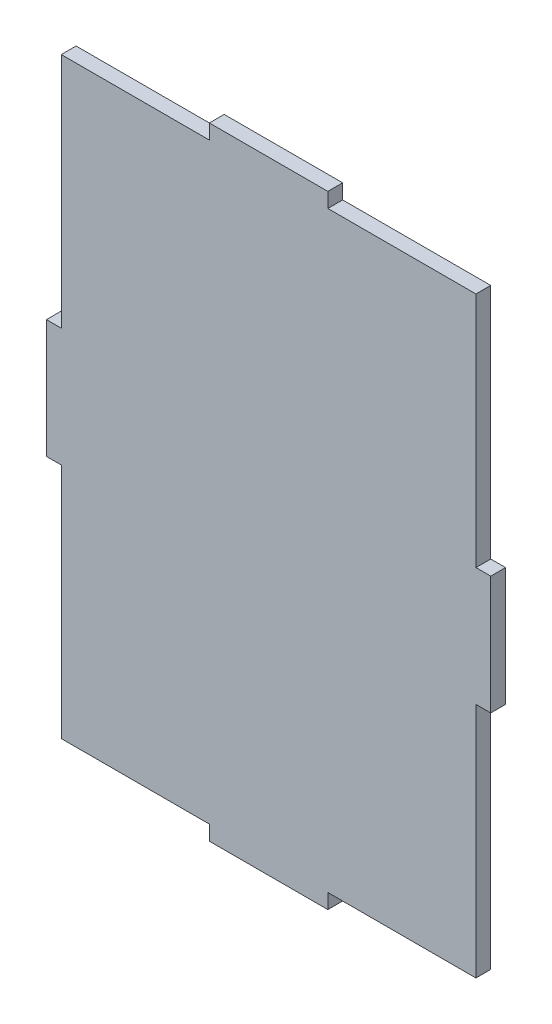
ISO-10303-21;
HEADER;
FILE_DESCRIPTION(('STEP AP214'),'2;1');
FILE_NAME('part.step','',(''),(''),'','','');
FILE_SCHEMA(('AUTOMOTIVE_DESIGN { 1 0 10303 214 1 1 1 1 }'));
ENDSEC;
DATA;
#1=APPLICATION_CONTEXT('core data for automotive mechanical design processes');
#2=APPLICATION_PROTOCOL_DEFINITION('international standard','automotive_design',2000,#1);
#3=PRODUCT_CONTEXT('',#1,'mechanical');
#4=PRODUCT('Part','Part','',(#3));
#5=PRODUCT_RELATED_PRODUCT_CATEGORY('part','',(#4));
#6=PRODUCT_DEFINITION_FORMATION('','',#4);
#7=PRODUCT_DEFINITION_CONTEXT('part definition',#1,'design');
#8=PRODUCT_DEFINITION('design','',#6,#7);
#9=PRODUCT_DEFINITION_SHAPE('','',#8);
#10=(LENGTH_UNIT() NAMED_UNIT(*) SI_UNIT(.MILLI.,.METRE.));
#11=(NAMED_UNIT(*) PLANE_ANGLE_UNIT() SI_UNIT($,.RADIAN.));
#12=(NAMED_UNIT(*) SI_UNIT($,.STERADIAN.) SOLID_ANGLE_UNIT());
#13=UNCERTAINTY_MEASURE_WITH_UNIT(LENGTH_MEASURE(1.E-05),#10,'distance_accuracy_value','');
#14=(GEOMETRIC_REPRESENTATION_CONTEXT(3) GLOBAL_UNCERTAINTY_ASSIGNED_CONTEXT((#13)) GLOBAL_UNIT_ASSIGNED_CONTEXT((#10,
#11,#12)) REPRESENTATION_CONTEXT('',''));
#15=CARTESIAN_POINT('',(0.,0.,0.));
#16=DIRECTION('',(0.,0.,1.));
#17=DIRECTION('',(1.,0.,0.));
#18=AXIS2_PLACEMENT_3D('',#15,#16,#17);
#19=CARTESIAN_POINT('',(-70.,20.,5.));
#20=DIRECTION('',(1.,0.,0.));
#21=DIRECTION('',(0.,0.,-1.));
#22=AXIS2_PLACEMENT_3D('',#19,#20,#21);
#23=PLANE('',#22);
#24=DIRECTION('',(0.,-1.,0.));
#25=VECTOR('',#24,1.);
#26=CARTESIAN_POINT('',(-70.,20.,0.));
#27=LINE('',#26,#25);
#28=CARTESIAN_POINT('',(-70.,100.,0.));
#29=VERTEX_POINT('',#28);
#30=CARTESIAN_POINT('',(-70.,20.,0.));
#31=VERTEX_POINT('',#30);
#32=EDGE_CURVE('E201',#29,#31,#27,.T.);
#33=ORIENTED_EDGE('',*,*,#32,.T.);
#34=DIRECTION('',(0.,0.,-1.));
#35=VECTOR('',#34,1.);
#36=CARTESIAN_POINT('',(-70.,20.,5.));
#37=LINE('',#36,#35);
#38=CARTESIAN_POINT('',(-70.,20.,5.));
#39=VERTEX_POINT('',#38);
#40=EDGE_CURVE('E11',#39,#31,#37,.T.);
#41=ORIENTED_EDGE('',*,*,#40,.F.);
#42=DIRECTION('',(0.,-1.,0.));
#43=VECTOR('',#42,1.);
#44=CARTESIAN_POINT('',(-70.,20.,5.));
#45=LINE('',#44,#43);
#46=CARTESIAN_POINT('',(-70.,100.,5.));
#47=VERTEX_POINT('',#46);
#48=EDGE_CURVE('E239',#47,#39,#45,.T.);
#49=ORIENTED_EDGE('',*,*,#48,.F.);
#50=DIRECTION('',(0.,0.,-1.));
#51=VECTOR('',#50,1.);
#52=CARTESIAN_POINT('',(-70.,100.,5.));
#53=LINE('',#52,#51);
#54=EDGE_CURVE('E197',#47,#29,#53,.T.);
#55=ORIENTED_EDGE('',*,*,#54,.T.);
#56=EDGE_LOOP('',(#33,#41,#49,#55));
#57=FACE_BOUND('',#56,.T.);
#58=ADVANCED_FACE('F33',(#57),#23,.F.);
#59=CARTESIAN_POINT('',(-70.,20.,5.));
#60=DIRECTION('',(0.,-1.,0.));
#61=DIRECTION('',(0.,0.,-1.));
#62=AXIS2_PLACEMENT_3D('',#59,#60,#61);
#63=PLANE('',#62);
#64=DIRECTION('',(-1.,0.,0.));
#65=VECTOR('',#64,1.);
#66=CARTESIAN_POINT('',(-70.,20.,0.));
#67=LINE('',#66,#65);
#68=CARTESIAN_POINT('',(-75.,20.,0.));
#69=VERTEX_POINT('',#68);
#70=EDGE_CURVE('E204',#31,#69,#67,.T.);
#71=ORIENTED_EDGE('',*,*,#70,.T.);
#72=DIRECTION('',(0.,0.,-1.));
#73=VECTOR('',#72,1.);
#74=CARTESIAN_POINT('',(-75.,20.,5.));
#75=LINE('',#74,#73);
#76=CARTESIAN_POINT('',(-75.,20.,5.));
#77=VERTEX_POINT('',#76);
#78=EDGE_CURVE('E41',#77,#69,#75,.T.);
#79=ORIENTED_EDGE('',*,*,#78,.F.);
#80=DIRECTION('',(-1.,0.,0.));
#81=VECTOR('',#80,1.);
#82=CARTESIAN_POINT('',(-70.,20.,5.));
#83=LINE('',#82,#81);
#84=EDGE_CURVE('E128',#39,#77,#83,.T.);
#85=ORIENTED_EDGE('',*,*,#84,.F.);
#86=ORIENTED_EDGE('',*,*,#40,.T.);
#87=EDGE_LOOP('',(#71,#79,#85,#86));
#88=FACE_BOUND('',#87,.T.);
#89=ADVANCED_FACE('F357',(#88),#63,.F.);
#90=CARTESIAN_POINT('',(-75.,-20.,5.));
#91=DIRECTION('',(1.,0.,0.));
#92=DIRECTION('',(0.,0.,-1.));
#93=AXIS2_PLACEMENT_3D('',#90,#91,#92);
#94=PLANE('',#93);
#95=DIRECTION('',(0.,-1.,0.));
#96=VECTOR('',#95,1.);
#97=CARTESIAN_POINT('',(-75.,-20.,0.));
#98=LINE('',#97,#96);
#99=CARTESIAN_POINT('',(-75.,-20.,0.));
#100=VERTEX_POINT('',#99);
#101=EDGE_CURVE('E206',#69,#100,#98,.T.);
#102=ORIENTED_EDGE('',*,*,#101,.T.);
#103=DIRECTION('',(0.,0.,-1.));
#104=VECTOR('',#103,1.);
#105=CARTESIAN_POINT('',(-75.,-20.,5.));
#106=LINE('',#105,#104);
#107=CARTESIAN_POINT('',(-75.,-20.,5.));
#108=VERTEX_POINT('',#107);
#109=EDGE_CURVE('E282',#108,#100,#106,.T.);
#110=ORIENTED_EDGE('',*,*,#109,.F.);
#111=DIRECTION('',(0.,-1.,0.));
#112=VECTOR('',#111,1.);
#113=CARTESIAN_POINT('',(-75.,-20.,5.));
#114=LINE('',#113,#112);
#115=EDGE_CURVE('E290',#77,#108,#114,.T.);
#116=ORIENTED_EDGE('',*,*,#115,.F.);
#117=ORIENTED_EDGE('',*,*,#78,.T.);
#118=EDGE_LOOP('',(#102,#110,#116,#117));
#119=FACE_BOUND('',#118,.T.);
#120=ADVANCED_FACE('F288',(#119),#94,.F.);
#121=CARTESIAN_POINT('',(-70.,-20.,5.));
#122=DIRECTION('',(0.,1.,0.));
#123=DIRECTION('',(-1.,0.,0.));
#124=AXIS2_PLACEMENT_3D('',#121,#122,#123);
#125=PLANE('',#124);
#126=DIRECTION('',(1.,0.,0.));
#127=VECTOR('',#126,1.);
#128=CARTESIAN_POINT('',(-70.,-20.,0.));
#129=LINE('',#128,#127);
#130=CARTESIAN_POINT('',(-70.,-20.,0.));
#131=VERTEX_POINT('',#130);
#132=EDGE_CURVE('E208',#100,#131,#129,.T.);
#133=ORIENTED_EDGE('',*,*,#132,.T.);
#134=DIRECTION('',(0.,0.,-1.));
#135=VECTOR('',#134,1.);
#136=CARTESIAN_POINT('',(-70.,-20.,5.));
#137=LINE('',#136,#135);
#138=CARTESIAN_POINT('',(-70.,-20.,5.));
#139=VERTEX_POINT('',#138);
#140=EDGE_CURVE('E279',#139,#131,#137,.T.);
#141=ORIENTED_EDGE('',*,*,#140,.F.);
#142=DIRECTION('',(1.,0.,0.));
#143=VECTOR('',#142,1.);
#144=CARTESIAN_POINT('',(-70.,-20.,5.));
#145=LINE('',#144,#143);
#146=EDGE_CURVE('E308',#108,#139,#145,.T.);
#147=ORIENTED_EDGE('',*,*,#146,.F.);
#148=ORIENTED_EDGE('',*,*,#109,.T.);
#149=EDGE_LOOP('',(#133,#141,#147,#148));
#150=FACE_BOUND('',#149,.T.);
#151=ADVANCED_FACE('F299',(#150),#125,.F.);
#152=CARTESIAN_POINT('',(-70.,-100.,5.));
#153=DIRECTION('',(1.,0.,0.));
#154=DIRECTION('',(0.,0.,-1.));
#155=AXIS2_PLACEMENT_3D('',#152,#153,#154);
#156=PLANE('',#155);
#157=DIRECTION('',(0.,-1.,0.));
#158=VECTOR('',#157,1.);
#159=CARTESIAN_POINT('',(-70.,-100.,0.));
#160=LINE('',#159,#158);
#161=CARTESIAN_POINT('',(-70.,-100.,0.));
#162=VERTEX_POINT('',#161);
#163=EDGE_CURVE('E210',#131,#162,#160,.T.);
#164=ORIENTED_EDGE('',*,*,#163,.T.);
#165=DIRECTION('',(0.,0.,-1.));
#166=VECTOR('',#165,1.);
#167=CARTESIAN_POINT('',(-70.,-100.,5.));
#168=LINE('',#167,#166);
#169=CARTESIAN_POINT('',(-70.,-100.,5.));
#170=VERTEX_POINT('',#169);
#171=EDGE_CURVE('E276',#170,#162,#168,.T.);
#172=ORIENTED_EDGE('',*,*,#171,.F.);
#173=DIRECTION('',(0.,-1.,0.));
#174=VECTOR('',#173,1.);
#175=CARTESIAN_POINT('',(-70.,-100.,5.));
#176=LINE('',#175,#174);
#177=EDGE_CURVE('E305',#139,#170,#176,.T.);
#178=ORIENTED_EDGE('',*,*,#177,.F.);
#179=ORIENTED_EDGE('',*,*,#140,.T.);
#180=EDGE_LOOP('',(#164,#172,#178,#179));
#181=FACE_BOUND('',#180,.T.);
#182=ADVANCED_FACE('F303',(#181),#156,.F.);
#183=CARTESIAN_POINT('',(-20.,-100.,5.));
#184=DIRECTION('',(0.,1.,0.));
#185=DIRECTION('',(-1.,0.,0.));
#186=AXIS2_PLACEMENT_3D('',#183,#184,#185);
#187=PLANE('',#186);
#188=DIRECTION('',(1.,0.,0.));
#189=VECTOR('',#188,1.);
#190=CARTESIAN_POINT('',(-20.,-100.,0.));
#191=LINE('',#190,#189);
#192=CARTESIAN_POINT('',(-20.,-100.,0.));
#193=VERTEX_POINT('',#192);
#194=EDGE_CURVE('E212',#162,#193,#191,.T.);
#195=ORIENTED_EDGE('',*,*,#194,.T.);
#196=DIRECTION('',(0.,0.,-1.));
#197=VECTOR('',#196,1.);
#198=CARTESIAN_POINT('',(-20.,-100.,5.));
#199=LINE('',#198,#197);
#200=CARTESIAN_POINT('',(-20.,-100.,5.));
#201=VERTEX_POINT('',#200);
#202=EDGE_CURVE('E273',#201,#193,#199,.T.);
#203=ORIENTED_EDGE('',*,*,#202,.F.);
#204=DIRECTION('',(1.,0.,0.));
#205=VECTOR('',#204,1.);
#206=CARTESIAN_POINT('',(-20.,-100.,5.));
#207=LINE('',#206,#205);
#208=EDGE_CURVE('E307',#170,#201,#207,.T.);
#209=ORIENTED_EDGE('',*,*,#208,.F.);
#210=ORIENTED_EDGE('',*,*,#171,.T.);
#211=EDGE_LOOP('',(#195,#203,#209,#210));
#212=FACE_BOUND('',#211,.T.);
#213=ADVANCED_FACE('F370',(#212),#187,.F.);
#214=CARTESIAN_POINT('',(-20.,-100.,5.));
#215=DIRECTION('',(1.,0.,0.));
#216=DIRECTION('',(0.,0.,-1.));
#217=AXIS2_PLACEMENT_3D('',#214,#215,#216);
#218=PLANE('',#217);
#219=DIRECTION('',(0.,-1.,0.));
#220=VECTOR('',#219,1.);
#221=CARTESIAN_POINT('',(-20.,-100.,0.));
#222=LINE('',#221,#220);
#223=CARTESIAN_POINT('',(-20.,-105.,0.));
#224=VERTEX_POINT('',#223);
#225=EDGE_CURVE('E214',#193,#224,#222,.T.);
#226=ORIENTED_EDGE('',*,*,#225,.T.);
#227=DIRECTION('',(0.,0.,-1.));
#228=VECTOR('',#227,1.);
#229=CARTESIAN_POINT('',(-20.,-105.,5.));
#230=LINE('',#229,#228);
#231=CARTESIAN_POINT('',(-20.,-105.,5.));
#232=VERTEX_POINT('',#231);
#233=EDGE_CURVE('E270',#232,#224,#230,.T.);
#234=ORIENTED_EDGE('',*,*,#233,.F.);
#235=DIRECTION('',(0.,-1.,0.));
#236=VECTOR('',#235,1.);
#237=CARTESIAN_POINT('',(-20.,-100.,5.));
#238=LINE('',#237,#236);
#239=EDGE_CURVE('E310',#201,#232,#238,.T.);
#240=ORIENTED_EDGE('',*,*,#239,.F.);
#241=ORIENTED_EDGE('',*,*,#202,.T.);
#242=EDGE_LOOP('',(#226,#234,#240,#241));
#243=FACE_BOUND('',#242,.T.);
#244=ADVANCED_FACE('F373',(#243),#218,.F.);
#245=CARTESIAN_POINT('',(-20.,-105.,5.));
#246=DIRECTION('',(0.,1.,0.));
#247=DIRECTION('',(0.,0.,1.));
#248=AXIS2_PLACEMENT_3D('',#245,#246,#247);
#249=PLANE('',#248);
#250=DIRECTION('',(1.,0.,0.));
#251=VECTOR('',#250,1.);
#252=CARTESIAN_POINT('',(-20.,-105.,0.));
#253=LINE('',#252,#251);
#254=CARTESIAN_POINT('',(20.,-105.,0.));
#255=VERTEX_POINT('',#254);
#256=EDGE_CURVE('E216',#224,#255,#253,.T.);
#257=ORIENTED_EDGE('',*,*,#256,.T.);
#258=DIRECTION('',(0.,0.,-1.));
#259=VECTOR('',#258,1.);
#260=CARTESIAN_POINT('',(20.,-105.,5.));
#261=LINE('',#260,#259);
#262=CARTESIAN_POINT('',(20.,-105.,5.));
#263=VERTEX_POINT('',#262);
#264=EDGE_CURVE('E267',#263,#255,#261,.T.);
#265=ORIENTED_EDGE('',*,*,#264,.F.);
#266=DIRECTION('',(1.,0.,0.));
#267=VECTOR('',#266,1.);
#268=CARTESIAN_POINT('',(-20.,-105.,5.));
#269=LINE('',#268,#267);
#270=EDGE_CURVE('E316',#232,#263,#269,.T.);
#271=ORIENTED_EDGE('',*,*,#270,.F.);
#272=ORIENTED_EDGE('',*,*,#233,.T.);
#273=EDGE_LOOP('',(#257,#265,#271,#272));
#274=FACE_BOUND('',#273,.T.);
#275=ADVANCED_FACE('F377',(#274),#249,.F.);
#276=CARTESIAN_POINT('',(20.,-100.,5.));
#277=DIRECTION('',(-1.,0.,0.));
#278=DIRECTION('',(0.,0.,1.));
#279=AXIS2_PLACEMENT_3D('',#276,#277,#278);
#280=PLANE('',#279);
#281=DIRECTION('',(0.,1.,0.));
#282=VECTOR('',#281,1.);
#283=CARTESIAN_POINT('',(20.,-100.,0.));
#284=LINE('',#283,#282);
#285=CARTESIAN_POINT('',(20.,-100.,0.));
#286=VERTEX_POINT('',#285);
#287=EDGE_CURVE('E218',#255,#286,#284,.T.);
#288=ORIENTED_EDGE('',*,*,#287,.T.);
#289=DIRECTION('',(0.,0.,-1.));
#290=VECTOR('',#289,1.);
#291=CARTESIAN_POINT('',(20.,-100.,5.));
#292=LINE('',#291,#290);
#293=CARTESIAN_POINT('',(20.,-100.,5.));
#294=VERTEX_POINT('',#293);
#295=EDGE_CURVE('E264',#294,#286,#292,.T.);
#296=ORIENTED_EDGE('',*,*,#295,.F.);
#297=DIRECTION('',(0.,1.,0.));
#298=VECTOR('',#297,1.);
#299=CARTESIAN_POINT('',(20.,-100.,5.));
#300=LINE('',#299,#298);
#301=EDGE_CURVE('E318',#263,#294,#300,.T.);
#302=ORIENTED_EDGE('',*,*,#301,.F.);
#303=ORIENTED_EDGE('',*,*,#264,.T.);
#304=EDGE_LOOP('',(#288,#296,#302,#303));
#305=FACE_BOUND('',#304,.T.);
#306=ADVANCED_FACE('F381',(#305),#280,.F.);
#307=CARTESIAN_POINT('',(70.,-100.,5.));
#308=DIRECTION('',(0.,1.,0.));
#309=DIRECTION('',(-1.,0.,0.));
#310=AXIS2_PLACEMENT_3D('',#307,#308,#309);
#311=PLANE('',#310);
#312=DIRECTION('',(1.,0.,0.));
#313=VECTOR('',#312,1.);
#314=CARTESIAN_POINT('',(70.,-100.,0.));
#315=LINE('',#314,#313);
#316=CARTESIAN_POINT('',(70.,-100.,0.));
#317=VERTEX_POINT('',#316);
#318=EDGE_CURVE('E220',#286,#317,#315,.T.);
#319=ORIENTED_EDGE('',*,*,#318,.T.);
#320=DIRECTION('',(0.,0.,-1.));
#321=VECTOR('',#320,1.);
#322=CARTESIAN_POINT('',(70.,-100.,5.));
#323=LINE('',#322,#321);
#324=CARTESIAN_POINT('',(70.,-100.,5.));
#325=VERTEX_POINT('',#324);
#326=EDGE_CURVE('E261',#325,#317,#323,.T.);
#327=ORIENTED_EDGE('',*,*,#326,.F.);
#328=DIRECTION('',(1.,0.,0.));
#329=VECTOR('',#328,1.);
#330=CARTESIAN_POINT('',(70.,-100.,5.));
#331=LINE('',#330,#329);
#332=EDGE_CURVE('E320',#294,#325,#331,.T.);
#333=ORIENTED_EDGE('',*,*,#332,.F.);
#334=ORIENTED_EDGE('',*,*,#295,.T.);
#335=EDGE_LOOP('',(#319,#327,#333,#334));
#336=FACE_BOUND('',#335,.T.);
#337=ADVANCED_FACE('F385',(#336),#311,.F.);
#338=CARTESIAN_POINT('',(70.,-100.,5.));
#339=DIRECTION('',(-1.,0.,0.));
#340=DIRECTION('',(0.,0.,1.));
#341=AXIS2_PLACEMENT_3D('',#338,#339,#340);
#342=PLANE('',#341);
#343=DIRECTION('',(0.,1.,0.));
#344=VECTOR('',#343,1.);
#345=CARTESIAN_POINT('',(70.,-100.,0.));
#346=LINE('',#345,#344);
#347=CARTESIAN_POINT('',(70.,-20.,0.));
#348=VERTEX_POINT('',#347);
#349=EDGE_CURVE('E222',#317,#348,#346,.T.);
#350=ORIENTED_EDGE('',*,*,#349,.T.);
#351=DIRECTION('',(0.,0.,-1.));
#352=VECTOR('',#351,1.);
#353=CARTESIAN_POINT('',(70.,-20.,5.));
#354=LINE('',#353,#352);
#355=CARTESIAN_POINT('',(70.,-20.,5.));
#356=VERTEX_POINT('',#355);
#357=EDGE_CURVE('E258',#356,#348,#354,.T.);
#358=ORIENTED_EDGE('',*,*,#357,.F.);
#359=DIRECTION('',(0.,1.,0.));
#360=VECTOR('',#359,1.);
#361=CARTESIAN_POINT('',(70.,-100.,5.));
#362=LINE('',#361,#360);
#363=EDGE_CURVE('E322',#325,#356,#362,.T.);
#364=ORIENTED_EDGE('',*,*,#363,.F.);
#365=ORIENTED_EDGE('',*,*,#326,.T.);
#366=EDGE_LOOP('',(#350,#358,#364,#365));
#367=FACE_BOUND('',#366,.T.);
#368=ADVANCED_FACE('F389',(#367),#342,.F.);
#369=CARTESIAN_POINT('',(70.,-20.,5.));
#370=DIRECTION('',(0.,1.,0.));
#371=DIRECTION('',(-1.,0.,0.));
#372=AXIS2_PLACEMENT_3D('',#369,#370,#371);
#373=PLANE('',#372);
#374=DIRECTION('',(1.,0.,0.));
#375=VECTOR('',#374,1.);
#376=CARTESIAN_POINT('',(70.,-20.,0.));
#377=LINE('',#376,#375);
#378=CARTESIAN_POINT('',(75.,-20.,0.));
#379=VERTEX_POINT('',#378);
#380=EDGE_CURVE('E224',#348,#379,#377,.T.);
#381=ORIENTED_EDGE('',*,*,#380,.T.);
#382=DIRECTION('',(0.,0.,-1.));
#383=VECTOR('',#382,1.);
#384=CARTESIAN_POINT('',(75.,-20.,5.));
#385=LINE('',#384,#383);
#386=CARTESIAN_POINT('',(75.,-20.,5.));
#387=VERTEX_POINT('',#386);
#388=EDGE_CURVE('E255',#387,#379,#385,.T.);
#389=ORIENTED_EDGE('',*,*,#388,.F.);
#390=DIRECTION('',(1.,0.,0.));
#391=VECTOR('',#390,1.);
#392=CARTESIAN_POINT('',(70.,-20.,5.));
#393=LINE('',#392,#391);
#394=EDGE_CURVE('E324',#356,#387,#393,.T.);
#395=ORIENTED_EDGE('',*,*,#394,.F.);
#396=ORIENTED_EDGE('',*,*,#357,.T.);
#397=EDGE_LOOP('',(#381,#389,#395,#396));
#398=FACE_BOUND('',#397,.T.);
#399=ADVANCED_FACE('F393',(#398),#373,.F.);
#400=CARTESIAN_POINT('',(75.,-20.,5.));
#401=DIRECTION('',(-1.,0.,0.));
#402=DIRECTION('',(0.,0.,1.));
#403=AXIS2_PLACEMENT_3D('',#400,#401,#402);
#404=PLANE('',#403);
#405=DIRECTION('',(0.,1.,0.));
#406=VECTOR('',#405,1.);
#407=CARTESIAN_POINT('',(75.,-20.,0.));
#408=LINE('',#407,#406);
#409=CARTESIAN_POINT('',(75.,20.,0.));
#410=VERTEX_POINT('',#409);
#411=EDGE_CURVE('E226',#379,#410,#408,.T.);
#412=ORIENTED_EDGE('',*,*,#411,.T.);
#413=DIRECTION('',(0.,0.,-1.));
#414=VECTOR('',#413,1.);
#415=CARTESIAN_POINT('',(75.,20.,5.));
#416=LINE('',#415,#414);
#417=CARTESIAN_POINT('',(75.,20.,5.));
#418=VERTEX_POINT('',#417);
#419=EDGE_CURVE('E252',#418,#410,#416,.T.);
#420=ORIENTED_EDGE('',*,*,#419,.F.);
#421=DIRECTION('',(0.,1.,0.));
#422=VECTOR('',#421,1.);
#423=CARTESIAN_POINT('',(75.,-20.,5.));
#424=LINE('',#423,#422);
#425=EDGE_CURVE('E326',#387,#418,#424,.T.);
#426=ORIENTED_EDGE('',*,*,#425,.F.);
#427=ORIENTED_EDGE('',*,*,#388,.T.);
#428=EDGE_LOOP('',(#412,#420,#426,#427));
#429=FACE_BOUND('',#428,.T.);
#430=ADVANCED_FACE('F397',(#429),#404,.F.);
#431=CARTESIAN_POINT('',(70.,20.,5.));
#432=DIRECTION('',(0.,-1.,0.));
#433=DIRECTION('',(1.,0.,0.));
#434=AXIS2_PLACEMENT_3D('',#431,#432,#433);
#435=PLANE('',#434);
#436=DIRECTION('',(-1.,0.,0.));
#437=VECTOR('',#436,1.);
#438=CARTESIAN_POINT('',(70.,20.,0.));
#439=LINE('',#438,#437);
#440=CARTESIAN_POINT('',(70.,20.,0.));
#441=VERTEX_POINT('',#440);
#442=EDGE_CURVE('E228',#410,#441,#439,.T.);
#443=ORIENTED_EDGE('',*,*,#442,.T.);
#444=DIRECTION('',(0.,0.,-1.));
#445=VECTOR('',#444,1.);
#446=CARTESIAN_POINT('',(70.,20.,5.));
#447=LINE('',#446,#445);
#448=CARTESIAN_POINT('',(70.,20.,5.));
#449=VERTEX_POINT('',#448);
#450=EDGE_CURVE('E249',#449,#441,#447,.T.);
#451=ORIENTED_EDGE('',*,*,#450,.F.);
#452=DIRECTION('',(-1.,0.,0.));
#453=VECTOR('',#452,1.);
#454=CARTESIAN_POINT('',(70.,20.,5.));
#455=LINE('',#454,#453);
#456=EDGE_CURVE('E328',#418,#449,#455,.T.);
#457=ORIENTED_EDGE('',*,*,#456,.F.);
#458=ORIENTED_EDGE('',*,*,#419,.T.);
#459=EDGE_LOOP('',(#443,#451,#457,#458));
#460=FACE_BOUND('',#459,.T.);
#461=ADVANCED_FACE('F401',(#460),#435,.F.);
#462=CARTESIAN_POINT('',(70.,20.,5.));
#463=DIRECTION('',(-1.,0.,0.));
#464=DIRECTION('',(0.,0.,1.));
#465=AXIS2_PLACEMENT_3D('',#462,#463,#464);
#466=PLANE('',#465);
#467=DIRECTION('',(0.,1.,0.));
#468=VECTOR('',#467,1.);
#469=CARTESIAN_POINT('',(70.,20.,0.));
#470=LINE('',#469,#468);
#471=CARTESIAN_POINT('',(70.,100.,0.));
#472=VERTEX_POINT('',#471);
#473=EDGE_CURVE('E230',#441,#472,#470,.T.);
#474=ORIENTED_EDGE('',*,*,#473,.T.);
#475=DIRECTION('',(0.,0.,-1.));
#476=VECTOR('',#475,1.);
#477=CARTESIAN_POINT('',(70.,100.,5.));
#478=LINE('',#477,#476);
#479=CARTESIAN_POINT('',(70.,100.,5.));
#480=VERTEX_POINT('',#479);
#481=EDGE_CURVE('E246',#480,#472,#478,.T.);
#482=ORIENTED_EDGE('',*,*,#481,.F.);
#483=DIRECTION('',(0.,1.,0.));
#484=VECTOR('',#483,1.);
#485=CARTESIAN_POINT('',(70.,20.,5.));
#486=LINE('',#485,#484);
#487=EDGE_CURVE('E330',#449,#480,#486,.T.);
#488=ORIENTED_EDGE('',*,*,#487,.F.);
#489=ORIENTED_EDGE('',*,*,#450,.T.);
#490=EDGE_LOOP('',(#474,#482,#488,#489));
#491=FACE_BOUND('',#490,.T.);
#492=ADVANCED_FACE('F405',(#491),#466,.F.);
#493=CARTESIAN_POINT('',(70.,100.,5.));
#494=DIRECTION('',(0.,-1.,0.));
#495=DIRECTION('',(1.,0.,0.));
#496=AXIS2_PLACEMENT_3D('',#493,#494,#495);
#497=PLANE('',#496);
#498=DIRECTION('',(-1.,0.,0.));
#499=VECTOR('',#498,1.);
#500=CARTESIAN_POINT('',(70.,100.,0.));
#501=LINE('',#500,#499);
#502=CARTESIAN_POINT('',(20.,100.,0.));
#503=VERTEX_POINT('',#502);
#504=EDGE_CURVE('E232',#472,#503,#501,.T.);
#505=ORIENTED_EDGE('',*,*,#504,.T.);
#506=DIRECTION('',(0.,0.,-1.));
#507=VECTOR('',#506,1.);
#508=CARTESIAN_POINT('',(20.,100.,5.));
#509=LINE('',#508,#507);
#510=CARTESIAN_POINT('',(20.,100.,5.));
#511=VERTEX_POINT('',#510);
#512=EDGE_CURVE('E243',#511,#503,#509,.T.);
#513=ORIENTED_EDGE('',*,*,#512,.F.);
#514=DIRECTION('',(-1.,0.,0.));
#515=VECTOR('',#514,1.);
#516=CARTESIAN_POINT('',(70.,100.,5.));
#517=LINE('',#516,#515);
#518=EDGE_CURVE('E332',#480,#511,#517,.T.);
#519=ORIENTED_EDGE('',*,*,#518,.F.);
#520=ORIENTED_EDGE('',*,*,#481,.T.);
#521=EDGE_LOOP('',(#505,#513,#519,#520));
#522=FACE_BOUND('',#521,.T.);
#523=ADVANCED_FACE('F338',(#522),#497,.F.);
#524=CARTESIAN_POINT('',(20.,100.,5.));
#525=DIRECTION('',(-1.,0.,0.));
#526=DIRECTION('',(0.,0.,1.));
#527=AXIS2_PLACEMENT_3D('',#524,#525,#526);
#528=PLANE('',#527);
#529=DIRECTION('',(0.,1.,0.));
#530=VECTOR('',#529,1.);
#531=CARTESIAN_POINT('',(20.,100.,0.));
#532=LINE('',#531,#530);
#533=CARTESIAN_POINT('',(20.,105.,0.));
#534=VERTEX_POINT('',#533);
#535=EDGE_CURVE('E234',#503,#534,#532,.T.);
#536=ORIENTED_EDGE('',*,*,#535,.T.);
#537=DIRECTION('',(0.,0.,-1.));
#538=VECTOR('',#537,1.);
#539=CARTESIAN_POINT('',(20.,105.,5.));
#540=LINE('',#539,#538);
#541=CARTESIAN_POINT('',(20.,105.,5.));
#542=VERTEX_POINT('',#541);
#543=EDGE_CURVE('E192',#542,#534,#540,.T.);
#544=ORIENTED_EDGE('',*,*,#543,.F.);
#545=DIRECTION('',(0.,1.,0.));
#546=VECTOR('',#545,1.);
#547=CARTESIAN_POINT('',(20.,100.,5.));
#548=LINE('',#547,#546);
#549=EDGE_CURVE('E183',#511,#542,#548,.T.);
#550=ORIENTED_EDGE('',*,*,#549,.F.);
#551=ORIENTED_EDGE('',*,*,#512,.T.);
#552=EDGE_LOOP('',(#536,#544,#550,#551));
#553=FACE_BOUND('',#552,.T.);
#554=ADVANCED_FACE('F342',(#553),#528,.F.);
#555=CARTESIAN_POINT('',(-20.,105.,5.));
#556=DIRECTION('',(0.,-1.,0.));
#557=DIRECTION('',(1.,0.,0.));
#558=AXIS2_PLACEMENT_3D('',#555,#556,#557);
#559=PLANE('',#558);
#560=DIRECTION('',(-1.,0.,0.));
#561=VECTOR('',#560,1.);
#562=CARTESIAN_POINT('',(-20.,105.,0.));
#563=LINE('',#562,#561);
#564=CARTESIAN_POINT('',(-20.,105.,0.));
#565=VERTEX_POINT('',#564);
#566=EDGE_CURVE('E191',#534,#565,#563,.T.);
#567=ORIENTED_EDGE('',*,*,#566,.T.);
#568=DIRECTION('',(0.,0.,-1.));
#569=VECTOR('',#568,1.);
#570=CARTESIAN_POINT('',(-20.,105.,5.));
#571=LINE('',#570,#569);
#572=CARTESIAN_POINT('',(-20.,105.,5.));
#573=VERTEX_POINT('',#572);
#574=EDGE_CURVE('E188',#573,#565,#571,.T.);
#575=ORIENTED_EDGE('',*,*,#574,.F.);
#576=DIRECTION('',(-1.,0.,0.));
#577=VECTOR('',#576,1.);
#578=CARTESIAN_POINT('',(-20.,105.,5.));
#579=LINE('',#578,#577);
#580=EDGE_CURVE('E177',#542,#573,#579,.T.);
#581=ORIENTED_EDGE('',*,*,#580,.F.);
#582=ORIENTED_EDGE('',*,*,#543,.T.);
#583=EDGE_LOOP('',(#567,#575,#581,#582));
#584=FACE_BOUND('',#583,.T.);
#585=ADVANCED_FACE('F189',(#584),#559,.F.);
#586=CARTESIAN_POINT('',(-20.,100.,5.));
#587=DIRECTION('',(1.,0.,0.));
#588=DIRECTION('',(0.,0.,-1.));
#589=AXIS2_PLACEMENT_3D('',#586,#587,#588);
#590=PLANE('',#589);
#591=DIRECTION('',(0.,-1.,0.));
#592=VECTOR('',#591,1.);
#593=CARTESIAN_POINT('',(-20.,100.,0.));
#594=LINE('',#593,#592);
#595=CARTESIAN_POINT('',(-20.,100.,0.));
#596=VERTEX_POINT('',#595);
#597=EDGE_CURVE('E114',#565,#596,#594,.T.);
#598=ORIENTED_EDGE('',*,*,#597,.T.);
#599=DIRECTION('',(0.,0.,-1.));
#600=VECTOR('',#599,1.);
#601=CARTESIAN_POINT('',(-20.,100.,5.));
#602=LINE('',#601,#600);
#603=CARTESIAN_POINT('',(-20.,100.,5.));
#604=VERTEX_POINT('',#603);
#605=EDGE_CURVE('E193',#604,#596,#602,.T.);
#606=ORIENTED_EDGE('',*,*,#605,.F.);
#607=DIRECTION('',(0.,-1.,0.));
#608=VECTOR('',#607,1.);
#609=CARTESIAN_POINT('',(-20.,100.,5.));
#610=LINE('',#609,#608);
#611=EDGE_CURVE('E181',#573,#604,#610,.T.);
#612=ORIENTED_EDGE('',*,*,#611,.F.);
#613=ORIENTED_EDGE('',*,*,#574,.T.);
#614=EDGE_LOOP('',(#598,#606,#612,#613));
#615=FACE_BOUND('',#614,.T.);
#616=ADVANCED_FACE('F195',(#615),#590,.F.);
#617=CARTESIAN_POINT('',(-20.,100.,5.));
#618=DIRECTION('',(0.,-1.,0.));
#619=DIRECTION('',(1.,0.,0.));
#620=AXIS2_PLACEMENT_3D('',#617,#618,#619);
#621=PLANE('',#620);
#622=DIRECTION('',(-1.,0.,0.));
#623=VECTOR('',#622,1.);
#624=CARTESIAN_POINT('',(-20.,100.,0.));
#625=LINE('',#624,#623);
#626=EDGE_CURVE('E120',#596,#29,#625,.T.);
#627=ORIENTED_EDGE('',*,*,#626,.T.);
#628=ORIENTED_EDGE('',*,*,#54,.F.);
#629=DIRECTION('',(-1.,0.,0.));
#630=VECTOR('',#629,1.);
#631=CARTESIAN_POINT('',(-20.,100.,5.));
#632=LINE('',#631,#630);
#633=EDGE_CURVE('E49',#604,#47,#632,.T.);
#634=ORIENTED_EDGE('',*,*,#633,.F.);
#635=ORIENTED_EDGE('',*,*,#605,.T.);
#636=EDGE_LOOP('',(#627,#628,#634,#635));
#637=FACE_BOUND('',#636,.T.);
#638=ADVANCED_FACE('F346',(#637),#621,.F.);
#639=CARTESIAN_POINT('',(0.,0.,5.));
#640=DIRECTION('',(0.,0.,1.));
#641=DIRECTION('',(1.,0.,0.));
#642=AXIS2_PLACEMENT_3D('',#639,#640,#641);
#643=PLANE('',#642);
#644=ORIENTED_EDGE('',*,*,#48,.T.);
#645=ORIENTED_EDGE('',*,*,#84,.T.);
#646=ORIENTED_EDGE('',*,*,#115,.T.);
#647=ORIENTED_EDGE('',*,*,#146,.T.);
#648=ORIENTED_EDGE('',*,*,#177,.T.);
#649=ORIENTED_EDGE('',*,*,#208,.T.);
#650=ORIENTED_EDGE('',*,*,#239,.T.);
#651=ORIENTED_EDGE('',*,*,#270,.T.);
#652=ORIENTED_EDGE('',*,*,#301,.T.);
#653=ORIENTED_EDGE('',*,*,#332,.T.);
#654=ORIENTED_EDGE('',*,*,#363,.T.);
#655=ORIENTED_EDGE('',*,*,#394,.T.);
#656=ORIENTED_EDGE('',*,*,#425,.T.);
#657=ORIENTED_EDGE('',*,*,#456,.T.);
#658=ORIENTED_EDGE('',*,*,#487,.T.);
#659=ORIENTED_EDGE('',*,*,#518,.T.);
#660=ORIENTED_EDGE('',*,*,#549,.T.);
#661=ORIENTED_EDGE('',*,*,#580,.T.);
#662=ORIENTED_EDGE('',*,*,#611,.T.);
#663=ORIENTED_EDGE('',*,*,#633,.T.);
#664=EDGE_LOOP('',(#644,#645,#646,#647,#648,#649,#650,#651,#652,#653,#654,#655,#656,#657,#658,
#659,#660,#661,#662,#663));
#665=FACE_BOUND('',#664,.T.);
#666=ADVANCED_FACE('F179',(#665),#643,.T.);
#667=CARTESIAN_POINT('',(0.,0.,0.));
#668=DIRECTION('',(0.,0.,1.));
#669=DIRECTION('',(1.,0.,0.));
#670=AXIS2_PLACEMENT_3D('',#667,#668,#669);
#671=PLANE('',#670);
#672=ORIENTED_EDGE('',*,*,#32,.F.);
#673=ORIENTED_EDGE('',*,*,#626,.F.);
#674=ORIENTED_EDGE('',*,*,#597,.F.);
#675=ORIENTED_EDGE('',*,*,#566,.F.);
#676=ORIENTED_EDGE('',*,*,#535,.F.);
#677=ORIENTED_EDGE('',*,*,#504,.F.);
#678=ORIENTED_EDGE('',*,*,#473,.F.);
#679=ORIENTED_EDGE('',*,*,#442,.F.);
#680=ORIENTED_EDGE('',*,*,#411,.F.);
#681=ORIENTED_EDGE('',*,*,#380,.F.);
#682=ORIENTED_EDGE('',*,*,#349,.F.);
#683=ORIENTED_EDGE('',*,*,#318,.F.);
#684=ORIENTED_EDGE('',*,*,#287,.F.);
#685=ORIENTED_EDGE('',*,*,#256,.F.);
#686=ORIENTED_EDGE('',*,*,#225,.F.);
#687=ORIENTED_EDGE('',*,*,#194,.F.);
#688=ORIENTED_EDGE('',*,*,#163,.F.);
#689=ORIENTED_EDGE('',*,*,#132,.F.);
#690=ORIENTED_EDGE('',*,*,#101,.F.);
#691=ORIENTED_EDGE('',*,*,#70,.F.);
#692=EDGE_LOOP('',(#672,#673,#674,#675,#676,#677,#678,#679,#680,#681,#682,#683,#684,#685,#686,
#687,#688,#689,#690,#691));
#693=FACE_BOUND('',#692,.T.);
#694=ADVANCED_FACE('F294',(#693),#671,.F.);
#695=CLOSED_SHELL('',(#58,#89,#120,#151,#182,#213,#244,#275,#306,#337,#368,#399,#430,#461,#492,
#523,#554,#585,#616,#638,#666,#694));
#696=MANIFOLD_SOLID_BREP('B2',#695);
#697=ADVANCED_BREP_SHAPE_REPRESENTATION('',(#18,#696),#14);
#698=SHAPE_DEFINITION_REPRESENTATION(#9,#697);
ENDSEC;
END-ISO-10303-21;
